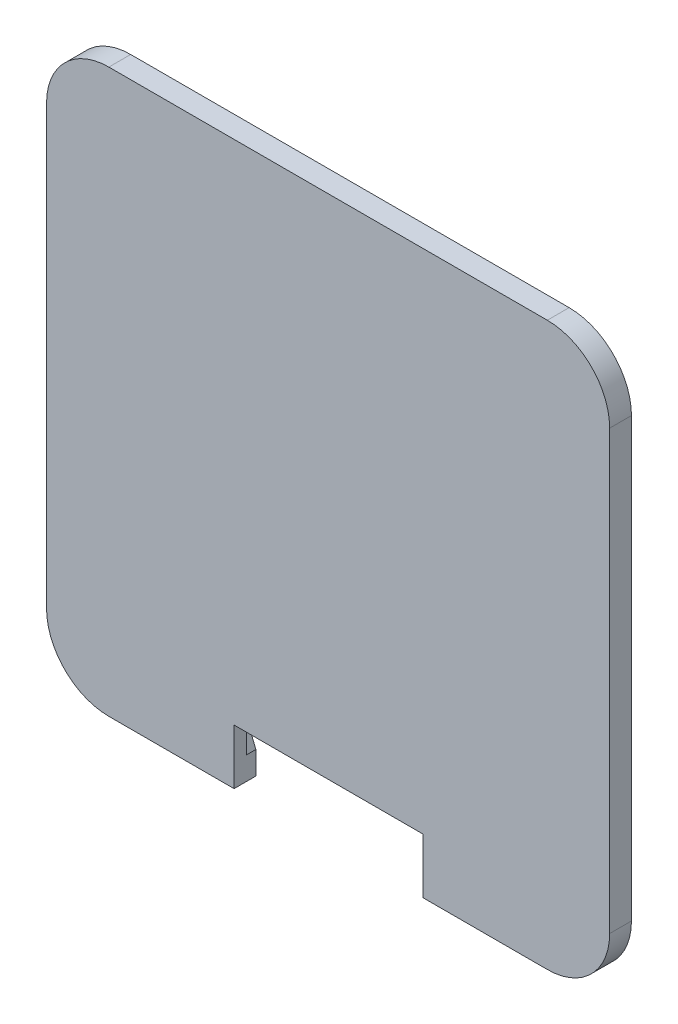
ISO-10303-21;
HEADER;
FILE_DESCRIPTION(('STEP AP214'),'2;1');
FILE_NAME('part.step','',(''),(''),'','','');
FILE_SCHEMA(('AUTOMOTIVE_DESIGN { 1 0 10303 214 1 1 1 1 }'));
ENDSEC;
DATA;
#1=APPLICATION_CONTEXT('core data for automotive mechanical design processes');
#2=APPLICATION_PROTOCOL_DEFINITION('international standard','automotive_design',2000,#1);
#3=PRODUCT_CONTEXT('',#1,'mechanical');
#4=PRODUCT('Part','Part','',(#3));
#5=PRODUCT_RELATED_PRODUCT_CATEGORY('part','',(#4));
#6=PRODUCT_DEFINITION_FORMATION('','',#4);
#7=PRODUCT_DEFINITION_CONTEXT('part definition',#1,'design');
#8=PRODUCT_DEFINITION('design','',#6,#7);
#9=PRODUCT_DEFINITION_SHAPE('','',#8);
#10=(LENGTH_UNIT() NAMED_UNIT(*) SI_UNIT(.MILLI.,.METRE.));
#11=(NAMED_UNIT(*) PLANE_ANGLE_UNIT() SI_UNIT($,.RADIAN.));
#12=(NAMED_UNIT(*) SI_UNIT($,.STERADIAN.) SOLID_ANGLE_UNIT());
#13=UNCERTAINTY_MEASURE_WITH_UNIT(LENGTH_MEASURE(1.E-05),#10,'distance_accuracy_value','');
#14=(GEOMETRIC_REPRESENTATION_CONTEXT(3) GLOBAL_UNCERTAINTY_ASSIGNED_CONTEXT((#13)) GLOBAL_UNIT_ASSIGNED_CONTEXT((#10,
#11,#12)) REPRESENTATION_CONTEXT('',''));
#15=CARTESIAN_POINT('',(0.,0.,0.));
#16=DIRECTION('',(0.,0.,1.));
#17=DIRECTION('',(1.,0.,0.));
#18=AXIS2_PLACEMENT_3D('',#15,#16,#17);
#19=CARTESIAN_POINT('',(24.9555,24.892,-1.5));
#20=DIRECTION('',(0.,0.,1.));
#21=DIRECTION('',(1.,0.,0.));
#22=AXIS2_PLACEMENT_3D('',#19,#20,#21);
#23=CYLINDRICAL_SURFACE('',#22,5.23);
#24=CARTESIAN_POINT('',(24.9555,24.892,0.));
#25=DIRECTION('',(0.,0.,1.));
#26=DIRECTION('',(1.,0.,0.));
#27=AXIS2_PLACEMENT_3D('',#24,#25,#26);
#28=CIRCLE('',#27,5.23);
#29=CARTESIAN_POINT('',(30.1855,24.892,0.));
#30=VERTEX_POINT('',#29);
#31=CARTESIAN_POINT('',(24.9555,30.122,0.));
#32=VERTEX_POINT('',#31);
#33=EDGE_CURVE('E221',#30,#32,#28,.T.);
#34=ORIENTED_EDGE('',*,*,#33,.T.);
#35=DIRECTION('',(0.,0.,1.));
#36=VECTOR('',#35,1.);
#37=CARTESIAN_POINT('',(24.9555,30.122,-1.5));
#38=LINE('',#37,#36);
#39=CARTESIAN_POINT('',(24.9555,30.122,-1.5));
#40=VERTEX_POINT('',#39);
#41=EDGE_CURVE('E11',#40,#32,#38,.T.);
#42=ORIENTED_EDGE('',*,*,#41,.F.);
#43=CARTESIAN_POINT('',(24.9555,24.892,-1.5));
#44=DIRECTION('',(0.,0.,1.));
#45=DIRECTION('',(1.,0.,0.));
#46=AXIS2_PLACEMENT_3D('',#43,#44,#45);
#47=CIRCLE('',#46,5.23);
#48=CARTESIAN_POINT('',(30.1855,24.892,-1.5));
#49=VERTEX_POINT('',#48);
#50=EDGE_CURVE('E230',#49,#40,#47,.T.);
#51=ORIENTED_EDGE('',*,*,#50,.F.);
#52=DIRECTION('',(0.,0.,1.));
#53=VECTOR('',#52,1.);
#54=CARTESIAN_POINT('',(30.1855,24.892,-1.5));
#55=LINE('',#54,#53);
#56=EDGE_CURVE('E39',#49,#30,#55,.T.);
#57=ORIENTED_EDGE('',*,*,#56,.T.);
#58=EDGE_LOOP('',(#34,#42,#51,#57));
#59=FACE_BOUND('',#58,.T.);
#60=ADVANCED_FACE('F36',(#59),#23,.F.);
#61=CARTESIAN_POINT('',(0.,30.122,-1.5));
#62=DIRECTION('',(0.,1.,0.));
#63=DIRECTION('',(-1.,0.,0.));
#64=AXIS2_PLACEMENT_3D('',#61,#62,#63);
#65=PLANE('',#64);
#66=DIRECTION('',(-1.,0.,0.));
#67=VECTOR('',#66,1.);
#68=CARTESIAN_POINT('',(0.,30.122,0.));
#69=LINE('',#68,#67);
#70=CARTESIAN_POINT('',(-24.9555,30.122,0.));
#71=VERTEX_POINT('',#70);
#72=EDGE_CURVE('E233',#32,#71,#69,.T.);
#73=ORIENTED_EDGE('',*,*,#72,.T.);
#74=DIRECTION('',(0.,0.,1.));
#75=VECTOR('',#74,1.);
#76=CARTESIAN_POINT('',(-24.9555,30.122,-1.5));
#77=LINE('',#76,#75);
#78=CARTESIAN_POINT('',(-24.9555,30.122,-1.5));
#79=VERTEX_POINT('',#78);
#80=EDGE_CURVE('E45',#79,#71,#77,.T.);
#81=ORIENTED_EDGE('',*,*,#80,.F.);
#82=DIRECTION('',(-1.,0.,0.));
#83=VECTOR('',#82,1.);
#84=CARTESIAN_POINT('',(0.,30.122,-1.5));
#85=LINE('',#84,#83);
#86=EDGE_CURVE('E52',#40,#79,#85,.T.);
#87=ORIENTED_EDGE('',*,*,#86,.F.);
#88=ORIENTED_EDGE('',*,*,#41,.T.);
#89=EDGE_LOOP('',(#73,#81,#87,#88));
#90=FACE_BOUND('',#89,.T.);
#91=ADVANCED_FACE('F468',(#90),#65,.F.);
#92=CARTESIAN_POINT('',(-24.9555,24.892,-1.5));
#93=DIRECTION('',(0.,0.,1.));
#94=DIRECTION('',(1.,0.,0.));
#95=AXIS2_PLACEMENT_3D('',#92,#93,#94);
#96=CYLINDRICAL_SURFACE('',#95,5.23);
#97=CARTESIAN_POINT('',(-24.9555,24.892,0.));
#98=DIRECTION('',(0.,0.,1.));
#99=DIRECTION('',(1.,0.,0.));
#100=AXIS2_PLACEMENT_3D('',#97,#98,#99);
#101=CIRCLE('',#100,5.23);
#102=CARTESIAN_POINT('',(-30.1855,24.892,0.));
#103=VERTEX_POINT('',#102);
#104=EDGE_CURVE('E299',#71,#103,#101,.T.);
#105=ORIENTED_EDGE('',*,*,#104,.T.);
#106=DIRECTION('',(0.,0.,1.));
#107=VECTOR('',#106,1.);
#108=CARTESIAN_POINT('',(-30.1855,24.892,-1.5));
#109=LINE('',#108,#107);
#110=CARTESIAN_POINT('',(-30.1855,24.892,-1.5));
#111=VERTEX_POINT('',#110);
#112=EDGE_CURVE('E306',#111,#103,#109,.T.);
#113=ORIENTED_EDGE('',*,*,#112,.F.);
#114=CARTESIAN_POINT('',(-24.9555,24.892,-1.5));
#115=DIRECTION('',(0.,0.,1.));
#116=DIRECTION('',(1.,0.,0.));
#117=AXIS2_PLACEMENT_3D('',#114,#115,#116);
#118=CIRCLE('',#117,5.23);
#119=EDGE_CURVE('E273',#79,#111,#118,.T.);
#120=ORIENTED_EDGE('',*,*,#119,.F.);
#121=ORIENTED_EDGE('',*,*,#80,.T.);
#122=EDGE_LOOP('',(#105,#113,#120,#121));
#123=FACE_BOUND('',#122,.T.);
#124=ADVANCED_FACE('F466',(#123),#96,.F.);
#125=CARTESIAN_POINT('',(-30.1855,0.,-1.5));
#126=DIRECTION('',(-1.,0.,0.));
#127=DIRECTION('',(0.,0.,1.));
#128=AXIS2_PLACEMENT_3D('',#125,#126,#127);
#129=PLANE('',#128);
#130=DIRECTION('',(0.,-1.,0.));
#131=VECTOR('',#130,1.);
#132=CARTESIAN_POINT('',(-30.1855,0.,0.));
#133=LINE('',#132,#131);
#134=CARTESIAN_POINT('',(-30.1855,-24.892,0.));
#135=VERTEX_POINT('',#134);
#136=EDGE_CURVE('E296',#103,#135,#133,.T.);
#137=ORIENTED_EDGE('',*,*,#136,.T.);
#138=DIRECTION('',(0.,0.,1.));
#139=VECTOR('',#138,1.);
#140=CARTESIAN_POINT('',(-30.1855,-24.892,-1.5));
#141=LINE('',#140,#139);
#142=CARTESIAN_POINT('',(-30.1855,-24.892,-1.5));
#143=VERTEX_POINT('',#142);
#144=EDGE_CURVE('E309',#143,#135,#141,.T.);
#145=ORIENTED_EDGE('',*,*,#144,.F.);
#146=DIRECTION('',(0.,-1.,0.));
#147=VECTOR('',#146,1.);
#148=CARTESIAN_POINT('',(-30.1855,0.,-1.5));
#149=LINE('',#148,#147);
#150=EDGE_CURVE('E271',#111,#143,#149,.T.);
#151=ORIENTED_EDGE('',*,*,#150,.F.);
#152=ORIENTED_EDGE('',*,*,#112,.T.);
#153=EDGE_LOOP('',(#137,#145,#151,#152));
#154=FACE_BOUND('',#153,.T.);
#155=ADVANCED_FACE('F462',(#154),#129,.F.);
#156=CARTESIAN_POINT('',(-24.9555,-24.892,-1.5));
#157=DIRECTION('',(0.,0.,1.));
#158=DIRECTION('',(1.,0.,0.));
#159=AXIS2_PLACEMENT_3D('',#156,#157,#158);
#160=CYLINDRICAL_SURFACE('',#159,5.23);
#161=CARTESIAN_POINT('',(-24.9555,-24.892,0.));
#162=DIRECTION('',(0.,0.,1.));
#163=DIRECTION('',(1.,0.,0.));
#164=AXIS2_PLACEMENT_3D('',#161,#162,#163);
#165=CIRCLE('',#164,5.23);
#166=CARTESIAN_POINT('',(-24.9555,-30.122,0.));
#167=VERTEX_POINT('',#166);
#168=EDGE_CURVE('E293',#135,#167,#165,.T.);
#169=ORIENTED_EDGE('',*,*,#168,.T.);
#170=DIRECTION('',(0.,0.,1.));
#171=VECTOR('',#170,1.);
#172=CARTESIAN_POINT('',(-24.9555,-30.122,-1.5));
#173=LINE('',#172,#171);
#174=CARTESIAN_POINT('',(-24.9555,-30.122,-1.5));
#175=VERTEX_POINT('',#174);
#176=EDGE_CURVE('E312',#175,#167,#173,.T.);
#177=ORIENTED_EDGE('',*,*,#176,.F.);
#178=CARTESIAN_POINT('',(-24.9555,-24.892,-1.5));
#179=DIRECTION('',(0.,0.,1.));
#180=DIRECTION('',(1.,0.,0.));
#181=AXIS2_PLACEMENT_3D('',#178,#179,#180);
#182=CIRCLE('',#181,5.23);
#183=EDGE_CURVE('E269',#143,#175,#182,.T.);
#184=ORIENTED_EDGE('',*,*,#183,.F.);
#185=ORIENTED_EDGE('',*,*,#144,.T.);
#186=EDGE_LOOP('',(#169,#177,#184,#185));
#187=FACE_BOUND('',#186,.T.);
#188=ADVANCED_FACE('F457',(#187),#160,.F.);
#189=CARTESIAN_POINT('',(0.,-30.122,-1.5));
#190=DIRECTION('',(0.,-1.,0.));
#191=DIRECTION('',(1.,0.,0.));
#192=AXIS2_PLACEMENT_3D('',#189,#190,#191);
#193=PLANE('',#192);
#194=DIRECTION('',(1.,0.,0.));
#195=VECTOR('',#194,1.);
#196=CARTESIAN_POINT('',(0.,-30.122,0.));
#197=LINE('',#196,#195);
#198=CARTESIAN_POINT('',(-19.7221075529831,-30.122,0.));
#199=VERTEX_POINT('',#198);
#200=EDGE_CURVE('E290',#167,#199,#197,.T.);
#201=ORIENTED_EDGE('',*,*,#200,.T.);
#202=DIRECTION('',(0.,0.,1.));
#203=VECTOR('',#202,1.);
#204=CARTESIAN_POINT('',(-19.7221075529831,-30.122,-1.5));
#205=LINE('',#204,#203);
#206=CARTESIAN_POINT('',(-19.7221075529831,-30.122,-1.5));
#207=VERTEX_POINT('',#206);
#208=EDGE_CURVE('E315',#207,#199,#205,.T.);
#209=ORIENTED_EDGE('',*,*,#208,.F.);
#210=DIRECTION('',(1.,0.,0.));
#211=VECTOR('',#210,1.);
#212=CARTESIAN_POINT('',(0.,-30.122,-1.5));
#213=LINE('',#212,#211);
#214=EDGE_CURVE('E267',#175,#207,#213,.T.);
#215=ORIENTED_EDGE('',*,*,#214,.F.);
#216=ORIENTED_EDGE('',*,*,#176,.T.);
#217=EDGE_LOOP('',(#201,#209,#215,#216));
#218=FACE_BOUND('',#217,.T.);
#219=ADVANCED_FACE('F454',(#218),#193,.F.);
#220=CARTESIAN_POINT('',(-27.4573939888341,-11.2606166358702,-1.5));
#221=DIRECTION('',(-0.925215412371616,-0.37944227586027,0.));
#222=DIRECTION('',(0.37944227586027,-0.925215412371616,0.));
#223=AXIS2_PLACEMENT_3D('',#220,#221,#222);
#224=PLANE('',#223);
#225=DIRECTION('',(0.37944227586027,-0.925215412371616,0.));
#226=VECTOR('',#225,1.);
#227=CARTESIAN_POINT('',(-27.4573939888341,-11.2606166358702,0.));
#228=LINE('',#227,#226);
#229=CARTESIAN_POINT('',(-15.0866075529831,-41.425,0.));
#230=VERTEX_POINT('',#229);
#231=EDGE_CURVE('E287',#199,#230,#228,.T.);
#232=ORIENTED_EDGE('',*,*,#231,.T.);
#233=DIRECTION('',(0.,0.,1.));
#234=VECTOR('',#233,1.);
#235=CARTESIAN_POINT('',(-15.0866075529831,-41.425,-1.5));
#236=LINE('',#235,#234);
#237=CARTESIAN_POINT('',(-15.0866075529831,-41.425,-1.5));
#238=VERTEX_POINT('',#237);
#239=EDGE_CURVE('E318',#238,#230,#236,.T.);
#240=ORIENTED_EDGE('',*,*,#239,.F.);
#241=DIRECTION('',(0.37944227586027,-0.925215412371616,0.));
#242=VECTOR('',#241,1.);
#243=CARTESIAN_POINT('',(-27.4573939888341,-11.2606166358702,-1.5));
#244=LINE('',#243,#242);
#245=EDGE_CURVE('E265',#207,#238,#244,.T.);
#246=ORIENTED_EDGE('',*,*,#245,.F.);
#247=ORIENTED_EDGE('',*,*,#208,.T.);
#248=EDGE_LOOP('',(#232,#240,#246,#247));
#249=FACE_BOUND('',#248,.T.);
#250=ADVANCED_FACE('F449',(#249),#224,.F.);
#251=CARTESIAN_POINT('',(-15.0866075529831,0.,-1.5));
#252=DIRECTION('',(-1.,0.,0.));
#253=DIRECTION('',(0.,0.,1.));
#254=AXIS2_PLACEMENT_3D('',#251,#252,#253);
#255=PLANE('',#254);
#256=ORIENTED_EDGE('',*,*,#239,.T.);
#257=DIRECTION('',(0.,1.,0.));
#258=VECTOR('',#257,1.);
#259=CARTESIAN_POINT('',(-15.0866075529831,0.,0.));
#260=LINE('',#259,#258);
#261=CARTESIAN_POINT('',(-15.0866075529831,-36.275,0.));
#262=VERTEX_POINT('',#261);
#263=EDGE_CURVE('E216',#230,#262,#260,.T.);
#264=ORIENTED_EDGE('',*,*,#263,.T.);
#265=DIRECTION('',(0.,0.,-1.));
#266=VECTOR('',#265,1.);
#267=CARTESIAN_POINT('',(-15.0866075529831,-36.275,2.));
#268=LINE('',#267,#266);
#269=CARTESIAN_POINT('',(-15.0866075529831,-36.275,2.));
#270=VERTEX_POINT('',#269);
#271=EDGE_CURVE('E222',#270,#262,#268,.T.);
#272=ORIENTED_EDGE('',*,*,#271,.F.);
#273=DIRECTION('',(0.,1.,0.));
#274=VECTOR('',#273,1.);
#275=CARTESIAN_POINT('',(-15.0866075529831,0.,2.));
#276=LINE('',#275,#274);
#277=CARTESIAN_POINT('',(-15.0866075529831,-45.122,2.));
#278=VERTEX_POINT('',#277);
#279=EDGE_CURVE('E212',#278,#270,#276,.T.);
#280=ORIENTED_EDGE('',*,*,#279,.F.);
#281=DIRECTION('',(0.,0.,1.));
#282=VECTOR('',#281,1.);
#283=CARTESIAN_POINT('',(-15.0866075529831,-45.122,-1.5));
#284=LINE('',#283,#282);
#285=CARTESIAN_POINT('',(-15.0866075529831,-45.122,-1.5));
#286=VERTEX_POINT('',#285);
#287=EDGE_CURVE('E321',#286,#278,#284,.T.);
#288=ORIENTED_EDGE('',*,*,#287,.F.);
#289=DIRECTION('',(0.,-1.,0.));
#290=VECTOR('',#289,1.);
#291=CARTESIAN_POINT('',(-15.0866075529831,0.,-1.5));
#292=LINE('',#291,#290);
#293=EDGE_CURVE('E263',#238,#286,#292,.T.);
#294=ORIENTED_EDGE('',*,*,#293,.F.);
#295=EDGE_LOOP('',(#256,#264,#272,#280,#288,#294));
#296=FACE_BOUND('',#295,.T.);
#297=ADVANCED_FACE('F446',(#296),#255,.F.);
#298=CARTESIAN_POINT('',(0.,-45.122,-1.5));
#299=DIRECTION('',(0.,-1.,0.));
#300=DIRECTION('',(0.,0.,-1.));
#301=AXIS2_PLACEMENT_3D('',#298,#299,#300);
#302=PLANE('',#301);
#303=ORIENTED_EDGE('',*,*,#287,.T.);
#304=DIRECTION('',(1.,0.,0.));
#305=VECTOR('',#304,1.);
#306=CARTESIAN_POINT('',(0.,-45.122,2.));
#307=LINE('',#306,#305);
#308=CARTESIAN_POINT('',(-35.1854999999999,-45.122,2.));
#309=VERTEX_POINT('',#308);
#310=EDGE_CURVE('E378',#309,#278,#307,.T.);
#311=ORIENTED_EDGE('',*,*,#310,.F.);
#312=DIRECTION('',(0.,0.,1.));
#313=VECTOR('',#312,1.);
#314=CARTESIAN_POINT('',(-35.1854999999999,-45.122,-1.5));
#315=LINE('',#314,#313);
#316=CARTESIAN_POINT('',(-35.1854999999999,-45.122,-1.5));
#317=VERTEX_POINT('',#316);
#318=EDGE_CURVE('E323',#317,#309,#315,.T.);
#319=ORIENTED_EDGE('',*,*,#318,.F.);
#320=DIRECTION('',(1.,0.,0.));
#321=VECTOR('',#320,1.);
#322=CARTESIAN_POINT('',(0.,-45.122,-1.5));
#323=LINE('',#322,#321);
#324=EDGE_CURVE('E247',#317,#286,#323,.T.);
#325=ORIENTED_EDGE('',*,*,#324,.T.);
#326=EDGE_LOOP('',(#303,#311,#319,#325));
#327=FACE_BOUND('',#326,.T.);
#328=ADVANCED_FACE('F441',(#327),#302,.T.);
#329=CARTESIAN_POINT('',(-35.1855,-35.122,-1.5));
#330=DIRECTION('',(0.,0.,1.));
#331=DIRECTION('',(1.,0.,0.));
#332=AXIS2_PLACEMENT_3D('',#329,#330,#331);
#333=CYLINDRICAL_SURFACE('',#332,9.99999999999999);
#334=ORIENTED_EDGE('',*,*,#318,.T.);
#335=CARTESIAN_POINT('',(-35.1855,-35.122,2.));
#336=DIRECTION('',(0.,0.,1.));
#337=DIRECTION('',(1.,0.,0.));
#338=AXIS2_PLACEMENT_3D('',#335,#336,#337);
#339=CIRCLE('',#338,9.99999999999999);
#340=CARTESIAN_POINT('',(-45.1855,-35.1219999999999,2.));
#341=VERTEX_POINT('',#340);
#342=EDGE_CURVE('E380',#341,#309,#339,.T.);
#343=ORIENTED_EDGE('',*,*,#342,.F.);
#344=DIRECTION('',(0.,0.,1.));
#345=VECTOR('',#344,1.);
#346=CARTESIAN_POINT('',(-45.1855,-35.1219999999999,-1.5));
#347=LINE('',#346,#345);
#348=CARTESIAN_POINT('',(-45.1855,-35.1219999999999,-1.5));
#349=VERTEX_POINT('',#348);
#350=EDGE_CURVE('E325',#349,#341,#347,.T.);
#351=ORIENTED_EDGE('',*,*,#350,.F.);
#352=CARTESIAN_POINT('',(-35.1855,-35.122,-1.5));
#353=DIRECTION('',(0.,0.,1.));
#354=DIRECTION('',(1.,0.,0.));
#355=AXIS2_PLACEMENT_3D('',#352,#353,#354);
#356=CIRCLE('',#355,9.99999999999999);
#357=EDGE_CURVE('E261',#317,#349,#356,.F.);
#358=ORIENTED_EDGE('',*,*,#357,.F.);
#359=EDGE_LOOP('',(#334,#343,#351,#358));
#360=FACE_BOUND('',#359,.T.);
#361=ADVANCED_FACE('F437',(#360),#333,.T.);
#362=CARTESIAN_POINT('',(-45.1855,0.,-1.5));
#363=DIRECTION('',(1.,0.,0.));
#364=DIRECTION('',(0.,0.,-1.));
#365=AXIS2_PLACEMENT_3D('',#362,#363,#364);
#366=PLANE('',#365);
#367=ORIENTED_EDGE('',*,*,#350,.T.);
#368=DIRECTION('',(0.,-1.,0.));
#369=VECTOR('',#368,1.);
#370=CARTESIAN_POINT('',(-45.1855,0.,2.));
#371=LINE('',#370,#369);
#372=CARTESIAN_POINT('',(-45.1855,35.1219999999999,2.));
#373=VERTEX_POINT('',#372);
#374=EDGE_CURVE('E383',#373,#341,#371,.T.);
#375=ORIENTED_EDGE('',*,*,#374,.F.);
#376=DIRECTION('',(0.,0.,1.));
#377=VECTOR('',#376,1.);
#378=CARTESIAN_POINT('',(-45.1855,35.1219999999999,-1.5));
#379=LINE('',#378,#377);
#380=CARTESIAN_POINT('',(-45.1855,35.1219999999999,-1.5));
#381=VERTEX_POINT('',#380);
#382=EDGE_CURVE('E327',#381,#373,#379,.T.);
#383=ORIENTED_EDGE('',*,*,#382,.F.);
#384=DIRECTION('',(0.,1.,0.));
#385=VECTOR('',#384,1.);
#386=CARTESIAN_POINT('',(-45.1855,0.,-1.5));
#387=LINE('',#386,#385);
#388=EDGE_CURVE('E259',#349,#381,#387,.T.);
#389=ORIENTED_EDGE('',*,*,#388,.F.);
#390=EDGE_LOOP('',(#367,#375,#383,#389));
#391=FACE_BOUND('',#390,.T.);
#392=ADVANCED_FACE('F432',(#391),#366,.F.);
#393=CARTESIAN_POINT('',(-35.1855,35.122,-1.5));
#394=DIRECTION('',(0.,0.,1.));
#395=DIRECTION('',(1.,0.,0.));
#396=AXIS2_PLACEMENT_3D('',#393,#394,#395);
#397=CYLINDRICAL_SURFACE('',#396,9.99999999999999);
#398=ORIENTED_EDGE('',*,*,#382,.T.);
#399=CARTESIAN_POINT('',(-35.1855,35.122,2.));
#400=DIRECTION('',(0.,0.,1.));
#401=DIRECTION('',(1.,0.,0.));
#402=AXIS2_PLACEMENT_3D('',#399,#400,#401);
#403=CIRCLE('',#402,9.99999999999999);
#404=CARTESIAN_POINT('',(-35.1854999999999,45.122,2.));
#405=VERTEX_POINT('',#404);
#406=EDGE_CURVE('E386',#405,#373,#403,.T.);
#407=ORIENTED_EDGE('',*,*,#406,.F.);
#408=DIRECTION('',(0.,0.,1.));
#409=VECTOR('',#408,1.);
#410=CARTESIAN_POINT('',(-35.1854999999999,45.122,-1.5));
#411=LINE('',#410,#409);
#412=CARTESIAN_POINT('',(-35.1854999999999,45.122,-1.5));
#413=VERTEX_POINT('',#412);
#414=EDGE_CURVE('E329',#413,#405,#411,.T.);
#415=ORIENTED_EDGE('',*,*,#414,.F.);
#416=CARTESIAN_POINT('',(-35.1855,35.122,-1.5));
#417=DIRECTION('',(0.,0.,1.));
#418=DIRECTION('',(1.,0.,0.));
#419=AXIS2_PLACEMENT_3D('',#416,#417,#418);
#420=CIRCLE('',#419,9.99999999999999);
#421=EDGE_CURVE('E257',#381,#413,#420,.F.);
#422=ORIENTED_EDGE('',*,*,#421,.F.);
#423=EDGE_LOOP('',(#398,#407,#415,#422));
#424=FACE_BOUND('',#423,.T.);
#425=ADVANCED_FACE('F427',(#424),#397,.T.);
#426=CARTESIAN_POINT('',(0.,45.122,-1.5));
#427=DIRECTION('',(0.,-1.,0.));
#428=DIRECTION('',(0.,0.,-1.));
#429=AXIS2_PLACEMENT_3D('',#426,#427,#428);
#430=PLANE('',#429);
#431=ORIENTED_EDGE('',*,*,#414,.T.);
#432=DIRECTION('',(-1.,0.,0.));
#433=VECTOR('',#432,1.);
#434=CARTESIAN_POINT('',(0.,45.122,2.));
#435=LINE('',#434,#433);
#436=CARTESIAN_POINT('',(35.1854999999999,45.122,2.));
#437=VERTEX_POINT('',#436);
#438=EDGE_CURVE('E389',#437,#405,#435,.T.);
#439=ORIENTED_EDGE('',*,*,#438,.F.);
#440=DIRECTION('',(0.,0.,1.));
#441=VECTOR('',#440,1.);
#442=CARTESIAN_POINT('',(35.1854999999999,45.122,-1.5));
#443=LINE('',#442,#441);
#444=CARTESIAN_POINT('',(35.1854999999999,45.122,-1.5));
#445=VERTEX_POINT('',#444);
#446=EDGE_CURVE('E331',#445,#437,#443,.T.);
#447=ORIENTED_EDGE('',*,*,#446,.F.);
#448=DIRECTION('',(1.,0.,0.));
#449=VECTOR('',#448,1.);
#450=CARTESIAN_POINT('',(0.,45.122,-1.5));
#451=LINE('',#450,#449);
#452=EDGE_CURVE('E255',#413,#445,#451,.T.);
#453=ORIENTED_EDGE('',*,*,#452,.F.);
#454=EDGE_LOOP('',(#431,#439,#447,#453));
#455=FACE_BOUND('',#454,.T.);
#456=ADVANCED_FACE('F423',(#455),#430,.F.);
#457=CARTESIAN_POINT('',(35.1855,35.122,-1.5));
#458=DIRECTION('',(0.,0.,1.));
#459=DIRECTION('',(1.,0.,0.));
#460=AXIS2_PLACEMENT_3D('',#457,#458,#459);
#461=CYLINDRICAL_SURFACE('',#460,9.99999999999999);
#462=ORIENTED_EDGE('',*,*,#446,.T.);
#463=CARTESIAN_POINT('',(35.1855,35.122,2.));
#464=DIRECTION('',(0.,0.,1.));
#465=DIRECTION('',(1.,0.,0.));
#466=AXIS2_PLACEMENT_3D('',#463,#464,#465);
#467=CIRCLE('',#466,9.99999999999999);
#468=CARTESIAN_POINT('',(45.1855,35.122,2.));
#469=VERTEX_POINT('',#468);
#470=EDGE_CURVE('E392',#469,#437,#467,.T.);
#471=ORIENTED_EDGE('',*,*,#470,.F.);
#472=DIRECTION('',(0.,0.,1.));
#473=VECTOR('',#472,1.);
#474=CARTESIAN_POINT('',(45.1855,35.1219999999999,-1.5));
#475=LINE('',#474,#473);
#476=CARTESIAN_POINT('',(45.1855,35.1219999999999,-1.5));
#477=VERTEX_POINT('',#476);
#478=EDGE_CURVE('E333',#477,#469,#475,.T.);
#479=ORIENTED_EDGE('',*,*,#478,.F.);
#480=CARTESIAN_POINT('',(35.1855,35.122,-1.5));
#481=DIRECTION('',(0.,0.,1.));
#482=DIRECTION('',(1.,0.,0.));
#483=AXIS2_PLACEMENT_3D('',#480,#481,#482);
#484=CIRCLE('',#483,9.99999999999999);
#485=EDGE_CURVE('E253',#445,#477,#484,.F.);
#486=ORIENTED_EDGE('',*,*,#485,.F.);
#487=EDGE_LOOP('',(#462,#471,#479,#486));
#488=FACE_BOUND('',#487,.T.);
#489=ADVANCED_FACE('F419',(#488),#461,.T.);
#490=CARTESIAN_POINT('',(45.1855,0.,-1.5));
#491=DIRECTION('',(1.,0.,0.));
#492=DIRECTION('',(0.,0.,-1.));
#493=AXIS2_PLACEMENT_3D('',#490,#491,#492);
#494=PLANE('',#493);
#495=ORIENTED_EDGE('',*,*,#478,.T.);
#496=DIRECTION('',(0.,1.,0.));
#497=VECTOR('',#496,1.);
#498=CARTESIAN_POINT('',(45.1855,0.,2.));
#499=LINE('',#498,#497);
#500=CARTESIAN_POINT('',(45.1855,-35.1219999999999,2.));
#501=VERTEX_POINT('',#500);
#502=EDGE_CURVE('E395',#501,#469,#499,.T.);
#503=ORIENTED_EDGE('',*,*,#502,.F.);
#504=DIRECTION('',(0.,0.,1.));
#505=VECTOR('',#504,1.);
#506=CARTESIAN_POINT('',(45.1855,-35.1219999999999,-1.5));
#507=LINE('',#506,#505);
#508=CARTESIAN_POINT('',(45.1855,-35.1219999999999,-1.5));
#509=VERTEX_POINT('',#508);
#510=EDGE_CURVE('E335',#509,#501,#507,.T.);
#511=ORIENTED_EDGE('',*,*,#510,.F.);
#512=DIRECTION('',(0.,1.,0.));
#513=VECTOR('',#512,1.);
#514=CARTESIAN_POINT('',(45.1855,0.,-1.5));
#515=LINE('',#514,#513);
#516=EDGE_CURVE('E250',#509,#477,#515,.T.);
#517=ORIENTED_EDGE('',*,*,#516,.T.);
#518=EDGE_LOOP('',(#495,#503,#511,#517));
#519=FACE_BOUND('',#518,.T.);
#520=ADVANCED_FACE('F409',(#519),#494,.T.);
#521=CARTESIAN_POINT('',(35.1855,-35.122,-1.5));
#522=DIRECTION('',(0.,0.,1.));
#523=DIRECTION('',(1.,0.,0.));
#524=AXIS2_PLACEMENT_3D('',#521,#522,#523);
#525=CYLINDRICAL_SURFACE('',#524,9.99999999999999);
#526=ORIENTED_EDGE('',*,*,#510,.T.);
#527=CARTESIAN_POINT('',(35.1855,-35.122,2.));
#528=DIRECTION('',(0.,0.,1.));
#529=DIRECTION('',(1.,0.,0.));
#530=AXIS2_PLACEMENT_3D('',#527,#528,#529);
#531=CIRCLE('',#530,9.99999999999999);
#532=CARTESIAN_POINT('',(35.1854999999999,-45.122,2.));
#533=VERTEX_POINT('',#532);
#534=EDGE_CURVE('E398',#533,#501,#531,.T.);
#535=ORIENTED_EDGE('',*,*,#534,.F.);
#536=DIRECTION('',(0.,0.,1.));
#537=VECTOR('',#536,1.);
#538=CARTESIAN_POINT('',(35.1854999999999,-45.122,-1.5));
#539=LINE('',#538,#537);
#540=CARTESIAN_POINT('',(35.1854999999999,-45.122,-1.5));
#541=VERTEX_POINT('',#540);
#542=EDGE_CURVE('E337',#541,#533,#539,.T.);
#543=ORIENTED_EDGE('',*,*,#542,.F.);
#544=CARTESIAN_POINT('',(35.1855,-35.122,-1.5));
#545=DIRECTION('',(0.,0.,1.));
#546=DIRECTION('',(1.,0.,0.));
#547=AXIS2_PLACEMENT_3D('',#544,#545,#546);
#548=CIRCLE('',#547,9.99999999999999);
#549=EDGE_CURVE('E246',#541,#509,#548,.T.);
#550=ORIENTED_EDGE('',*,*,#549,.T.);
#551=EDGE_LOOP('',(#526,#535,#543,#550));
#552=FACE_BOUND('',#551,.T.);
#553=ADVANCED_FACE('F405',(#552),#525,.T.);
#554=ORIENTED_EDGE('',*,*,#542,.T.);
#555=DIRECTION('',(1.,0.,0.));
#556=VECTOR('',#555,1.);
#557=CARTESIAN_POINT('',(0.,-45.122,2.));
#558=LINE('',#557,#556);
#559=CARTESIAN_POINT('',(15.2146609654219,-45.122,2.));
#560=VERTEX_POINT('',#559);
#561=EDGE_CURVE('E205',#560,#533,#558,.T.);
#562=ORIENTED_EDGE('',*,*,#561,.F.);
#563=DIRECTION('',(0.,0.,1.));
#564=VECTOR('',#563,1.);
#565=CARTESIAN_POINT('',(15.2146609654219,-45.122,-1.5));
#566=LINE('',#565,#564);
#567=CARTESIAN_POINT('',(15.2146609654219,-45.122,-1.5));
#568=VERTEX_POINT('',#567);
#569=EDGE_CURVE('E201',#568,#560,#566,.T.);
#570=ORIENTED_EDGE('',*,*,#569,.F.);
#571=EDGE_CURVE('E243',#568,#541,#323,.T.);
#572=ORIENTED_EDGE('',*,*,#571,.T.);
#573=EDGE_LOOP('',(#554,#562,#570,#572));
#574=FACE_BOUND('',#573,.T.);
#575=ADVANCED_FACE('F491',(#574),#302,.T.);
#576=CARTESIAN_POINT('',(15.2146609654219,0.,-1.5));
#577=DIRECTION('',(-1.,0.,0.));
#578=DIRECTION('',(0.,0.,1.));
#579=AXIS2_PLACEMENT_3D('',#576,#577,#578);
#580=PLANE('',#579);
#581=ORIENTED_EDGE('',*,*,#569,.T.);
#582=DIRECTION('',(0.,-1.,0.));
#583=VECTOR('',#582,1.);
#584=CARTESIAN_POINT('',(15.2146609654219,0.,2.));
#585=LINE('',#584,#583);
#586=CARTESIAN_POINT('',(15.2146609654219,-36.275,2.));
#587=VERTEX_POINT('',#586);
#588=EDGE_CURVE('E193',#587,#560,#585,.T.);
#589=ORIENTED_EDGE('',*,*,#588,.F.);
#590=DIRECTION('',(0.,0.,-1.));
#591=VECTOR('',#590,1.);
#592=CARTESIAN_POINT('',(15.2146609654219,-36.275,2.));
#593=LINE('',#592,#591);
#594=CARTESIAN_POINT('',(15.2146609654219,-36.275,0.));
#595=VERTEX_POINT('',#594);
#596=EDGE_CURVE('E198',#587,#595,#593,.T.);
#597=ORIENTED_EDGE('',*,*,#596,.T.);
#598=DIRECTION('',(0.,-1.,0.));
#599=VECTOR('',#598,1.);
#600=CARTESIAN_POINT('',(15.2146609654219,0.,0.));
#601=LINE('',#600,#599);
#602=CARTESIAN_POINT('',(15.2146609654219,-41.425,0.));
#603=VERTEX_POINT('',#602);
#604=EDGE_CURVE('E373',#595,#603,#601,.T.);
#605=ORIENTED_EDGE('',*,*,#604,.T.);
#606=DIRECTION('',(0.,0.,1.));
#607=VECTOR('',#606,1.);
#608=CARTESIAN_POINT('',(15.2146609654219,-41.425,-1.5));
#609=LINE('',#608,#607);
#610=CARTESIAN_POINT('',(15.2146609654219,-41.425,-1.5));
#611=VERTEX_POINT('',#610);
#612=EDGE_CURVE('E340',#611,#603,#609,.T.);
#613=ORIENTED_EDGE('',*,*,#612,.F.);
#614=DIRECTION('',(0.,-1.,0.));
#615=VECTOR('',#614,1.);
#616=CARTESIAN_POINT('',(15.2146609654219,0.,-1.5));
#617=LINE('',#616,#615);
#618=EDGE_CURVE('E241',#611,#568,#617,.T.);
#619=ORIENTED_EDGE('',*,*,#618,.T.);
#620=EDGE_LOOP('',(#581,#589,#597,#605,#613,#619));
#621=FACE_BOUND('',#620,.T.);
#622=ADVANCED_FACE('F195',(#621),#580,.T.);
#623=CARTESIAN_POINT('',(27.3816328938987,-10.9218872779034,-1.5));
#624=DIRECTION('',(0.928836129508278,-0.37049081570274,0.));
#625=DIRECTION('',(0.37049081570274,0.928836129508278,0.));
#626=AXIS2_PLACEMENT_3D('',#623,#624,#625);
#627=PLANE('',#626);
#628=DIRECTION('',(0.37049081570274,0.928836129508278,0.));
#629=VECTOR('',#628,1.);
#630=CARTESIAN_POINT('',(27.3816328938987,-10.9218872779034,0.));
#631=LINE('',#630,#629);
#632=CARTESIAN_POINT('',(19.7231609654219,-30.122,0.));
#633=VERTEX_POINT('',#632);
#634=EDGE_CURVE('E284',#603,#633,#631,.T.);
#635=ORIENTED_EDGE('',*,*,#634,.T.);
#636=DIRECTION('',(0.,0.,1.));
#637=VECTOR('',#636,1.);
#638=CARTESIAN_POINT('',(19.7231609654219,-30.122,-1.5));
#639=LINE('',#638,#637);
#640=CARTESIAN_POINT('',(19.7231609654219,-30.122,-1.5));
#641=VERTEX_POINT('',#640);
#642=EDGE_CURVE('E343',#641,#633,#639,.T.);
#643=ORIENTED_EDGE('',*,*,#642,.F.);
#644=DIRECTION('',(0.37049081570274,0.928836129508278,0.));
#645=VECTOR('',#644,1.);
#646=CARTESIAN_POINT('',(27.3816328938987,-10.9218872779034,-1.5));
#647=LINE('',#646,#645);
#648=EDGE_CURVE('E239',#611,#641,#647,.T.);
#649=ORIENTED_EDGE('',*,*,#648,.F.);
#650=ORIENTED_EDGE('',*,*,#612,.T.);
#651=EDGE_LOOP('',(#635,#643,#649,#650));
#652=FACE_BOUND('',#651,.T.);
#653=ADVANCED_FACE('F370',(#652),#627,.F.);
#654=CARTESIAN_POINT('',(0.,-30.122,-1.5));
#655=DIRECTION('',(0.,-1.,0.));
#656=DIRECTION('',(1.,0.,0.));
#657=AXIS2_PLACEMENT_3D('',#654,#655,#656);
#658=PLANE('',#657);
#659=DIRECTION('',(1.,0.,0.));
#660=VECTOR('',#659,1.);
#661=CARTESIAN_POINT('',(0.,-30.122,0.));
#662=LINE('',#661,#660);
#663=CARTESIAN_POINT('',(24.9555,-30.122,0.));
#664=VERTEX_POINT('',#663);
#665=EDGE_CURVE('E281',#633,#664,#662,.T.);
#666=ORIENTED_EDGE('',*,*,#665,.T.);
#667=DIRECTION('',(0.,0.,1.));
#668=VECTOR('',#667,1.);
#669=CARTESIAN_POINT('',(24.9555,-30.122,-1.5));
#670=LINE('',#669,#668);
#671=CARTESIAN_POINT('',(24.9555,-30.122,-1.5));
#672=VERTEX_POINT('',#671);
#673=EDGE_CURVE('E346',#672,#664,#670,.T.);
#674=ORIENTED_EDGE('',*,*,#673,.F.);
#675=DIRECTION('',(1.,0.,0.));
#676=VECTOR('',#675,1.);
#677=CARTESIAN_POINT('',(0.,-30.122,-1.5));
#678=LINE('',#677,#676);
#679=EDGE_CURVE('E237',#641,#672,#678,.T.);
#680=ORIENTED_EDGE('',*,*,#679,.F.);
#681=ORIENTED_EDGE('',*,*,#642,.T.);
#682=EDGE_LOOP('',(#666,#674,#680,#681));
#683=FACE_BOUND('',#682,.T.);
#684=ADVANCED_FACE('F367',(#683),#658,.F.);
#685=CARTESIAN_POINT('',(24.9555,-24.892,-1.5));
#686=DIRECTION('',(0.,0.,1.));
#687=DIRECTION('',(1.,0.,0.));
#688=AXIS2_PLACEMENT_3D('',#685,#686,#687);
#689=CYLINDRICAL_SURFACE('',#688,5.23);
#690=CARTESIAN_POINT('',(24.9555,-24.892,0.));
#691=DIRECTION('',(0.,0.,1.));
#692=DIRECTION('',(1.,0.,0.));
#693=AXIS2_PLACEMENT_3D('',#690,#691,#692);
#694=CIRCLE('',#693,5.23);
#695=CARTESIAN_POINT('',(30.1855,-24.892,0.));
#696=VERTEX_POINT('',#695);
#697=EDGE_CURVE('E278',#664,#696,#694,.T.);
#698=ORIENTED_EDGE('',*,*,#697,.T.);
#699=DIRECTION('',(0.,0.,1.));
#700=VECTOR('',#699,1.);
#701=CARTESIAN_POINT('',(30.1855,-24.892,-1.5));
#702=LINE('',#701,#700);
#703=CARTESIAN_POINT('',(30.1855,-24.892,-1.5));
#704=VERTEX_POINT('',#703);
#705=EDGE_CURVE('E348',#704,#696,#702,.T.);
#706=ORIENTED_EDGE('',*,*,#705,.F.);
#707=CARTESIAN_POINT('',(24.9555,-24.892,-1.5));
#708=DIRECTION('',(0.,0.,1.));
#709=DIRECTION('',(1.,0.,0.));
#710=AXIS2_PLACEMENT_3D('',#707,#708,#709);
#711=CIRCLE('',#710,5.23);
#712=EDGE_CURVE('E235',#672,#704,#711,.T.);
#713=ORIENTED_EDGE('',*,*,#712,.F.);
#714=ORIENTED_EDGE('',*,*,#673,.T.);
#715=EDGE_LOOP('',(#698,#706,#713,#714));
#716=FACE_BOUND('',#715,.T.);
#717=ADVANCED_FACE('F362',(#716),#689,.F.);
#718=CARTESIAN_POINT('',(30.1855,0.,-1.5));
#719=DIRECTION('',(1.,0.,0.));
#720=DIRECTION('',(0.,1.,0.));
#721=AXIS2_PLACEMENT_3D('',#718,#719,#720);
#722=PLANE('',#721);
#723=DIRECTION('',(0.,1.,0.));
#724=VECTOR('',#723,1.);
#725=CARTESIAN_POINT('',(30.1855,0.,0.));
#726=LINE('',#725,#724);
#727=EDGE_CURVE('E225',#696,#30,#726,.T.);
#728=ORIENTED_EDGE('',*,*,#727,.T.);
#729=ORIENTED_EDGE('',*,*,#56,.F.);
#730=DIRECTION('',(0.,1.,0.));
#731=VECTOR('',#730,1.);
#732=CARTESIAN_POINT('',(30.1855,0.,-1.5));
#733=LINE('',#732,#731);
#734=EDGE_CURVE('E232',#704,#49,#733,.T.);
#735=ORIENTED_EDGE('',*,*,#734,.F.);
#736=ORIENTED_EDGE('',*,*,#705,.T.);
#737=EDGE_LOOP('',(#728,#729,#735,#736));
#738=FACE_BOUND('',#737,.T.);
#739=ADVANCED_FACE('F358',(#738),#722,.F.);
#740=CARTESIAN_POINT('',(0.,0.,-1.5));
#741=DIRECTION('',(0.,0.,1.));
#742=DIRECTION('',(1.,0.,0.));
#743=AXIS2_PLACEMENT_3D('',#740,#741,#742);
#744=PLANE('',#743);
#745=ORIENTED_EDGE('',*,*,#50,.T.);
#746=ORIENTED_EDGE('',*,*,#86,.T.);
#747=ORIENTED_EDGE('',*,*,#119,.T.);
#748=ORIENTED_EDGE('',*,*,#150,.T.);
#749=ORIENTED_EDGE('',*,*,#183,.T.);
#750=ORIENTED_EDGE('',*,*,#214,.T.);
#751=ORIENTED_EDGE('',*,*,#245,.T.);
#752=ORIENTED_EDGE('',*,*,#293,.T.);
#753=ORIENTED_EDGE('',*,*,#324,.F.);
#754=ORIENTED_EDGE('',*,*,#357,.T.);
#755=ORIENTED_EDGE('',*,*,#388,.T.);
#756=ORIENTED_EDGE('',*,*,#421,.T.);
#757=ORIENTED_EDGE('',*,*,#452,.T.);
#758=ORIENTED_EDGE('',*,*,#485,.T.);
#759=ORIENTED_EDGE('',*,*,#516,.F.);
#760=ORIENTED_EDGE('',*,*,#549,.F.);
#761=ORIENTED_EDGE('',*,*,#571,.F.);
#762=ORIENTED_EDGE('',*,*,#618,.F.);
#763=ORIENTED_EDGE('',*,*,#648,.T.);
#764=ORIENTED_EDGE('',*,*,#679,.T.);
#765=ORIENTED_EDGE('',*,*,#712,.T.);
#766=ORIENTED_EDGE('',*,*,#734,.T.);
#767=EDGE_LOOP('',(#745,#746,#747,#748,#749,#750,#751,#752,#753,#754,#755,#756,#757,#758,#759,
#760,#761,#762,#763,#764,#765,#766));
#768=FACE_BOUND('',#767,.T.);
#769=ADVANCED_FACE('F411',(#768),#744,.F.);
#770=CARTESIAN_POINT('',(0.,-36.275,2.));
#771=DIRECTION('',(0.,1.,0.));
#772=DIRECTION('',(0.,0.,1.));
#773=AXIS2_PLACEMENT_3D('',#770,#771,#772);
#774=PLANE('',#773);
#775=DIRECTION('',(1.,0.,0.));
#776=VECTOR('',#775,1.);
#777=CARTESIAN_POINT('',(0.,-36.275,0.));
#778=LINE('',#777,#776);
#779=EDGE_CURVE('E220',#262,#595,#778,.T.);
#780=ORIENTED_EDGE('',*,*,#779,.T.);
#781=ORIENTED_EDGE('',*,*,#596,.F.);
#782=DIRECTION('',(1.,0.,0.));
#783=VECTOR('',#782,1.);
#784=CARTESIAN_POINT('',(0.,-36.275,2.));
#785=LINE('',#784,#783);
#786=EDGE_CURVE('E206',#270,#587,#785,.T.);
#787=ORIENTED_EDGE('',*,*,#786,.F.);
#788=ORIENTED_EDGE('',*,*,#271,.T.);
#789=EDGE_LOOP('',(#780,#781,#787,#788));
#790=FACE_BOUND('',#789,.T.);
#791=ADVANCED_FACE('F218',(#790),#774,.F.);
#792=CARTESIAN_POINT('',(0.,0.,2.));
#793=DIRECTION('',(0.,0.,1.));
#794=DIRECTION('',(1.,0.,0.));
#795=AXIS2_PLACEMENT_3D('',#792,#793,#794);
#796=PLANE('',#795);
#797=ORIENTED_EDGE('',*,*,#786,.T.);
#798=ORIENTED_EDGE('',*,*,#588,.T.);
#799=ORIENTED_EDGE('',*,*,#561,.T.);
#800=ORIENTED_EDGE('',*,*,#534,.T.);
#801=ORIENTED_EDGE('',*,*,#502,.T.);
#802=ORIENTED_EDGE('',*,*,#470,.T.);
#803=ORIENTED_EDGE('',*,*,#438,.T.);
#804=ORIENTED_EDGE('',*,*,#406,.T.);
#805=ORIENTED_EDGE('',*,*,#374,.T.);
#806=ORIENTED_EDGE('',*,*,#342,.T.);
#807=ORIENTED_EDGE('',*,*,#310,.T.);
#808=ORIENTED_EDGE('',*,*,#279,.T.);
#809=EDGE_LOOP('',(#797,#798,#799,#800,#801,#802,#803,#804,#805,#806,#807,#808));
#810=FACE_BOUND('',#809,.T.);
#811=ADVANCED_FACE('F209',(#810),#796,.T.);
#812=CARTESIAN_POINT('',(0.,0.,0.));
#813=DIRECTION('',(0.,0.,1.));
#814=DIRECTION('',(1.,0.,0.));
#815=AXIS2_PLACEMENT_3D('',#812,#813,#814);
#816=PLANE('',#815);
#817=ORIENTED_EDGE('',*,*,#634,.F.);
#818=ORIENTED_EDGE('',*,*,#604,.F.);
#819=ORIENTED_EDGE('',*,*,#779,.F.);
#820=ORIENTED_EDGE('',*,*,#263,.F.);
#821=ORIENTED_EDGE('',*,*,#231,.F.);
#822=ORIENTED_EDGE('',*,*,#200,.F.);
#823=ORIENTED_EDGE('',*,*,#168,.F.);
#824=ORIENTED_EDGE('',*,*,#136,.F.);
#825=ORIENTED_EDGE('',*,*,#104,.F.);
#826=ORIENTED_EDGE('',*,*,#72,.F.);
#827=ORIENTED_EDGE('',*,*,#33,.F.);
#828=ORIENTED_EDGE('',*,*,#727,.F.);
#829=ORIENTED_EDGE('',*,*,#697,.F.);
#830=ORIENTED_EDGE('',*,*,#665,.F.);
#831=EDGE_LOOP('',(#817,#818,#819,#820,#821,#822,#823,#824,#825,#826,#827,#828,#829,#830));
#832=FACE_BOUND('',#831,.T.);
#833=ADVANCED_FACE('F360',(#832),#816,.F.);
#834=CLOSED_SHELL('',(#60,#91,#124,#155,#188,#219,#250,#297,#328,#361,#392,#425,#456,#489,#520,
#553,#575,#622,#653,#684,#717,#739,#769,#791,#811,#833));
#835=MANIFOLD_SOLID_BREP('B2',#834);
#836=ADVANCED_BREP_SHAPE_REPRESENTATION('',(#18,#835),#14);
#837=SHAPE_DEFINITION_REPRESENTATION(#9,#836);
ENDSEC;
END-ISO-10303-21;
